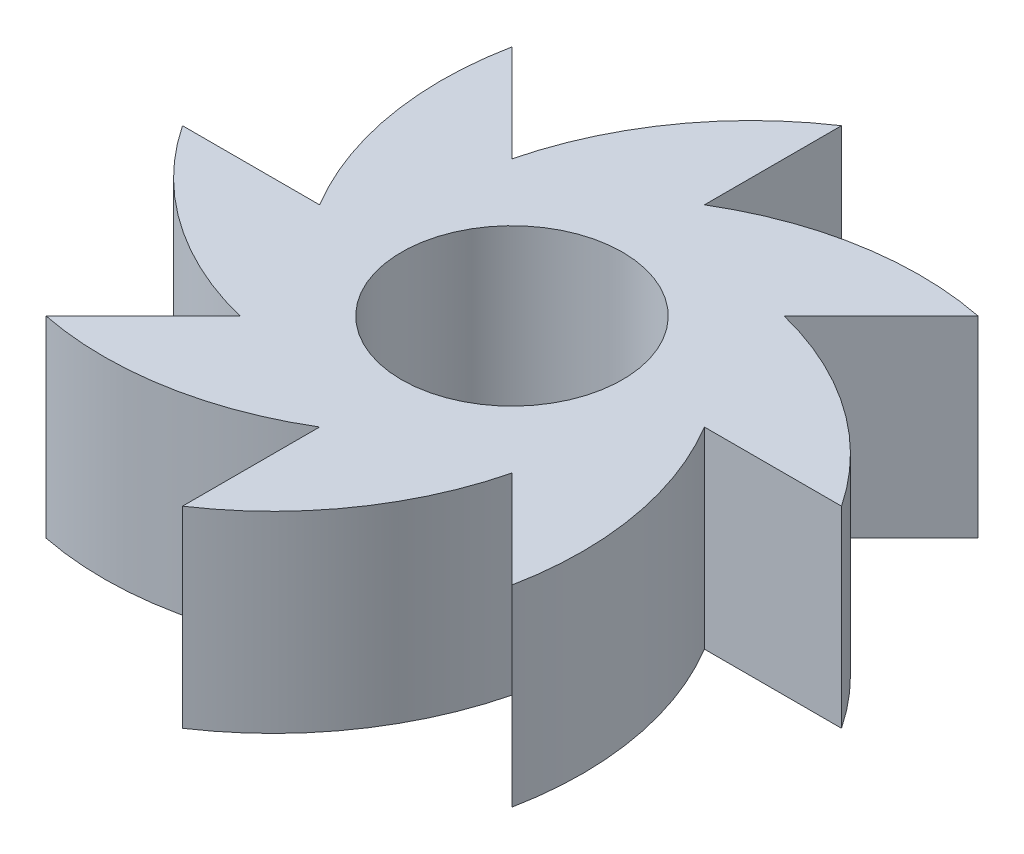
ISO-10303-21;
HEADER;
FILE_DESCRIPTION(('STEP AP214'),'2;1');
FILE_NAME('part.step','',(''),(''),'','','');
FILE_SCHEMA(('AUTOMOTIVE_DESIGN { 1 0 10303 214 1 1 1 1 }'));
ENDSEC;
DATA;
#1=APPLICATION_CONTEXT('core data for automotive mechanical design processes');
#2=APPLICATION_PROTOCOL_DEFINITION('international standard','automotive_design',2000,#1);
#3=PRODUCT_CONTEXT('',#1,'mechanical');
#4=PRODUCT('Part','Part','',(#3));
#5=PRODUCT_RELATED_PRODUCT_CATEGORY('part','',(#4));
#6=PRODUCT_DEFINITION_FORMATION('','',#4);
#7=PRODUCT_DEFINITION_CONTEXT('part definition',#1,'design');
#8=PRODUCT_DEFINITION('design','',#6,#7);
#9=PRODUCT_DEFINITION_SHAPE('','',#8);
#10=(LENGTH_UNIT() NAMED_UNIT(*) SI_UNIT(.MILLI.,.METRE.));
#11=(NAMED_UNIT(*) PLANE_ANGLE_UNIT() SI_UNIT($,.RADIAN.));
#12=(NAMED_UNIT(*) SI_UNIT($,.STERADIAN.) SOLID_ANGLE_UNIT());
#13=UNCERTAINTY_MEASURE_WITH_UNIT(LENGTH_MEASURE(1.E-05),#10,'distance_accuracy_value','');
#14=(GEOMETRIC_REPRESENTATION_CONTEXT(3) GLOBAL_UNCERTAINTY_ASSIGNED_CONTEXT((#13)) GLOBAL_UNIT_ASSIGNED_CONTEXT((#10,
#11,#12)) REPRESENTATION_CONTEXT('',''));
#15=CARTESIAN_POINT('',(0.,0.,0.));
#16=DIRECTION('',(0.,0.,1.));
#17=DIRECTION('',(1.,0.,0.));
#18=AXIS2_PLACEMENT_3D('',#15,#16,#17);
#19=CARTESIAN_POINT('',(-41.2716484049322,47.,-21.532116835391));
#20=DIRECTION('',(0.,-1.,0.));
#21=DIRECTION('',(0.,0.,-1.));
#22=AXIS2_PLACEMENT_3D('',#19,#20,#21);
#23=CYLINDRICAL_SURFACE('',#22,80.0000000000009);
#24=CARTESIAN_POINT('',(-41.2716484049322,0.,-21.532116835391));
#25=DIRECTION('',(0.,1.,0.));
#26=DIRECTION('',(0.,0.,1.));
#27=AXIS2_PLACEMENT_3D('',#24,#25,#26);
#28=CIRCLE('',#27,80.0000000000009);
#29=CARTESIAN_POINT('',(-1.06685493772574E-13,0.,47.));
#30=VERTEX_POINT('',#29);
#31=CARTESIAN_POINT('',(-56.9220958855151,0.,56.9220958855191));
#32=VERTEX_POINT('',#31);
#33=EDGE_CURVE('E196',#30,#32,#28,.F.);
#34=ORIENTED_EDGE('',*,*,#33,.F.);
#35=DIRECTION('',(0.,-1.,0.));
#36=VECTOR('',#35,1.);
#37=CARTESIAN_POINT('',(-1.06685493772574E-13,47.,47.));
#38=LINE('',#37,#36);
#39=CARTESIAN_POINT('',(-1.06685493772574E-13,47.,47.));
#40=VERTEX_POINT('',#39);
#41=EDGE_CURVE('E11',#40,#30,#38,.T.);
#42=ORIENTED_EDGE('',*,*,#41,.F.);
#43=CARTESIAN_POINT('',(-41.2716484049322,47.,-21.532116835391));
#44=DIRECTION('',(0.,1.,0.));
#45=DIRECTION('',(0.,0.,1.));
#46=AXIS2_PLACEMENT_3D('',#43,#44,#45);
#47=CIRCLE('',#46,80.0000000000009);
#48=CARTESIAN_POINT('',(-56.9220958855151,47.,56.9220958855191));
#49=VERTEX_POINT('',#48);
#50=EDGE_CURVE('E322',#40,#49,#47,.F.);
#51=ORIENTED_EDGE('',*,*,#50,.T.);
#52=DIRECTION('',(0.,-1.,0.));
#53=VECTOR('',#52,1.);
#54=CARTESIAN_POINT('',(-56.9220958855151,47.,56.9220958855191));
#55=LINE('',#54,#53);
#56=EDGE_CURVE('E63',#49,#32,#55,.T.);
#57=ORIENTED_EDGE('',*,*,#56,.T.);
#58=EDGE_LOOP('',(#34,#42,#51,#57));
#59=FACE_BOUND('',#58,.T.);
#60=ADVANCED_FACE('F45',(#59),#23,.T.);
#61=CARTESIAN_POINT('',(-3.70939494983768E-12,47.,0.));
#62=DIRECTION('',(-1.,0.,0.));
#63=DIRECTION('',(0.,0.,1.));
#64=AXIS2_PLACEMENT_3D('',#61,#62,#63);
#65=PLANE('',#64);
#66=DIRECTION('',(0.,0.,-1.));
#67=VECTOR('',#66,1.);
#68=CARTESIAN_POINT('',(-3.70939494983768E-12,0.,0.));
#69=LINE('',#68,#67);
#70=CARTESIAN_POINT('',(2.40029406712006E-12,0.,80.500000000001));
#71=VERTEX_POINT('',#70);
#72=EDGE_CURVE('E199',#71,#30,#69,.T.);
#73=ORIENTED_EDGE('',*,*,#72,.F.);
#74=DIRECTION('',(0.,-1.,0.));
#75=VECTOR('',#74,1.);
#76=CARTESIAN_POINT('',(2.40029406712006E-12,47.,80.500000000001));
#77=LINE('',#76,#75);
#78=CARTESIAN_POINT('',(2.40029406712006E-12,47.,80.500000000001));
#79=VERTEX_POINT('',#78);
#80=EDGE_CURVE('E55',#79,#71,#77,.T.);
#81=ORIENTED_EDGE('',*,*,#80,.F.);
#82=DIRECTION('',(0.,0.,-1.));
#83=VECTOR('',#82,1.);
#84=CARTESIAN_POINT('',(-3.70939494983768E-12,47.,0.));
#85=LINE('',#84,#83);
#86=EDGE_CURVE('E315',#79,#40,#85,.T.);
#87=ORIENTED_EDGE('',*,*,#86,.T.);
#88=ORIENTED_EDGE('',*,*,#41,.T.);
#89=EDGE_LOOP('',(#73,#81,#87,#88));
#90=FACE_BOUND('',#89,.T.);
#91=ADVANCED_FACE('F303',(#90),#65,.T.);
#92=CARTESIAN_POINT('',(-44.4089682854805,47.,13.9579566302686));
#93=DIRECTION('',(0.,-1.,0.));
#94=DIRECTION('',(0.,0.,-1.));
#95=AXIS2_PLACEMENT_3D('',#92,#93,#94);
#96=CYLINDRICAL_SURFACE('',#95,80.0000000000012);
#97=CARTESIAN_POINT('',(-44.4089682854805,0.,13.9579566302686));
#98=DIRECTION('',(0.,1.,0.));
#99=DIRECTION('',(0.,0.,1.));
#100=AXIS2_PLACEMENT_3D('',#97,#98,#99);
#101=CIRCLE('',#100,80.0000000000012);
#102=CARTESIAN_POINT('',(33.2340187157677,0.,33.2340187157678));
#103=VERTEX_POINT('',#102);
#104=EDGE_CURVE('E203',#103,#71,#101,.F.);
#105=ORIENTED_EDGE('',*,*,#104,.F.);
#106=DIRECTION('',(0.,-1.,0.));
#107=VECTOR('',#106,1.);
#108=CARTESIAN_POINT('',(33.2340187157677,47.,33.2340187157678));
#109=LINE('',#108,#107);
#110=CARTESIAN_POINT('',(33.2340187157677,47.,33.2340187157678));
#111=VERTEX_POINT('',#110);
#112=EDGE_CURVE('E290',#111,#103,#109,.T.);
#113=ORIENTED_EDGE('',*,*,#112,.F.);
#114=CARTESIAN_POINT('',(-44.4089682854805,47.,13.9579566302686));
#115=DIRECTION('',(0.,1.,0.));
#116=DIRECTION('',(0.,0.,1.));
#117=AXIS2_PLACEMENT_3D('',#114,#115,#116);
#118=CIRCLE('',#117,80.0000000000012);
#119=EDGE_CURVE('E299',#111,#79,#118,.F.);
#120=ORIENTED_EDGE('',*,*,#119,.T.);
#121=ORIENTED_EDGE('',*,*,#80,.T.);
#122=EDGE_LOOP('',(#105,#113,#120,#121));
#123=FACE_BOUND('',#122,.T.);
#124=ADVANCED_FACE('F297',(#123),#96,.T.);
#125=CARTESIAN_POINT('',(0.,47.,0.));
#126=DIRECTION('',(-0.707106781186549,0.,0.707106781186546));
#127=DIRECTION('',(0.707106781186546,0.,0.707106781186549));
#128=AXIS2_PLACEMENT_3D('',#125,#126,#127);
#129=PLANE('',#128);
#130=DIRECTION('',(-0.707106781186546,0.,-0.707106781186549));
#131=VECTOR('',#130,1.);
#132=CARTESIAN_POINT('',(0.,0.,0.));
#133=LINE('',#132,#131);
#134=CARTESIAN_POINT('',(56.922095885517,0.,56.9220958855172));
#135=VERTEX_POINT('',#134);
#136=EDGE_CURVE('E207',#135,#103,#133,.T.);
#137=ORIENTED_EDGE('',*,*,#136,.F.);
#138=DIRECTION('',(0.,-1.,0.));
#139=VECTOR('',#138,1.);
#140=CARTESIAN_POINT('',(56.922095885517,47.,56.9220958855172));
#141=LINE('',#140,#139);
#142=CARTESIAN_POINT('',(56.922095885517,47.,56.9220958855172));
#143=VERTEX_POINT('',#142);
#144=EDGE_CURVE('E287',#143,#135,#141,.T.);
#145=ORIENTED_EDGE('',*,*,#144,.F.);
#146=DIRECTION('',(-0.707106781186546,0.,-0.707106781186549));
#147=VECTOR('',#146,1.);
#148=CARTESIAN_POINT('',(0.,47.,0.));
#149=LINE('',#148,#147);
#150=EDGE_CURVE('E312',#143,#111,#149,.T.);
#151=ORIENTED_EDGE('',*,*,#150,.T.);
#152=ORIENTED_EDGE('',*,*,#112,.T.);
#153=EDGE_LOOP('',(#137,#145,#151,#152));
#154=FACE_BOUND('',#153,.T.);
#155=ADVANCED_FACE('F309',(#154),#129,.T.);
#156=CARTESIAN_POINT('',(-21.5321168353908,47.,41.2716484049323));
#157=DIRECTION('',(0.,-1.,0.));
#158=DIRECTION('',(0.,0.,-1.));
#159=AXIS2_PLACEMENT_3D('',#156,#157,#158);
#160=CYLINDRICAL_SURFACE('',#159,80.);
#161=CARTESIAN_POINT('',(-21.5321168353908,0.,41.2716484049323));
#162=DIRECTION('',(0.,1.,0.));
#163=DIRECTION('',(0.,0.,1.));
#164=AXIS2_PLACEMENT_3D('',#161,#162,#163);
#165=CIRCLE('',#164,80.);
#166=CARTESIAN_POINT('',(47.,0.,0.));
#167=VERTEX_POINT('',#166);
#168=EDGE_CURVE('E211',#167,#135,#165,.F.);
#169=ORIENTED_EDGE('',*,*,#168,.F.);
#170=DIRECTION('',(0.,-1.,0.));
#171=VECTOR('',#170,1.);
#172=CARTESIAN_POINT('',(47.,47.,0.));
#173=LINE('',#172,#171);
#174=CARTESIAN_POINT('',(47.,47.,0.));
#175=VERTEX_POINT('',#174);
#176=EDGE_CURVE('E284',#175,#167,#173,.T.);
#177=ORIENTED_EDGE('',*,*,#176,.F.);
#178=CARTESIAN_POINT('',(-21.5321168353908,47.,41.2716484049323));
#179=DIRECTION('',(0.,1.,0.));
#180=DIRECTION('',(0.,0.,1.));
#181=AXIS2_PLACEMENT_3D('',#178,#179,#180);
#182=CIRCLE('',#181,80.);
#183=EDGE_CURVE('E320',#175,#143,#182,.F.);
#184=ORIENTED_EDGE('',*,*,#183,.T.);
#185=ORIENTED_EDGE('',*,*,#144,.T.);
#186=EDGE_LOOP('',(#169,#177,#184,#185));
#187=FACE_BOUND('',#186,.T.);
#188=ADVANCED_FACE('F382',(#187),#160,.T.);
#189=CARTESIAN_POINT('',(0.,47.,0.));
#190=DIRECTION('',(0.,0.,1.));
#191=DIRECTION('',(1.,0.,0.));
#192=AXIS2_PLACEMENT_3D('',#189,#190,#191);
#193=PLANE('',#192);
#194=DIRECTION('',(-1.,0.,0.));
#195=VECTOR('',#194,1.);
#196=CARTESIAN_POINT('',(0.,0.,0.));
#197=LINE('',#196,#195);
#198=CARTESIAN_POINT('',(80.5,0.,0.));
#199=VERTEX_POINT('',#198);
#200=EDGE_CURVE('E215',#199,#167,#197,.T.);
#201=ORIENTED_EDGE('',*,*,#200,.F.);
#202=DIRECTION('',(0.,-1.,0.));
#203=VECTOR('',#202,1.);
#204=CARTESIAN_POINT('',(80.5,47.,0.));
#205=LINE('',#204,#203);
#206=CARTESIAN_POINT('',(80.5,47.,0.));
#207=VERTEX_POINT('',#206);
#208=EDGE_CURVE('E281',#207,#199,#205,.T.);
#209=ORIENTED_EDGE('',*,*,#208,.F.);
#210=DIRECTION('',(-1.,0.,0.));
#211=VECTOR('',#210,1.);
#212=CARTESIAN_POINT('',(0.,47.,0.));
#213=LINE('',#212,#211);
#214=EDGE_CURVE('E328',#207,#175,#213,.T.);
#215=ORIENTED_EDGE('',*,*,#214,.T.);
#216=ORIENTED_EDGE('',*,*,#176,.T.);
#217=EDGE_LOOP('',(#201,#209,#215,#216));
#218=FACE_BOUND('',#217,.T.);
#219=ADVANCED_FACE('F385',(#218),#193,.T.);
#220=CARTESIAN_POINT('',(13.9579566302688,47.,44.4089682854805));
#221=DIRECTION('',(0.,-1.,0.));
#222=DIRECTION('',(0.,0.,-1.));
#223=AXIS2_PLACEMENT_3D('',#220,#221,#222);
#224=CYLINDRICAL_SURFACE('',#223,80.);
#225=CARTESIAN_POINT('',(13.9579566302688,0.,44.4089682854805));
#226=DIRECTION('',(0.,1.,0.));
#227=DIRECTION('',(0.,0.,1.));
#228=AXIS2_PLACEMENT_3D('',#225,#226,#227);
#229=CIRCLE('',#228,80.);
#230=CARTESIAN_POINT('',(33.2340187157677,0.,-33.2340187157678));
#231=VERTEX_POINT('',#230);
#232=EDGE_CURVE('E219',#231,#199,#229,.F.);
#233=ORIENTED_EDGE('',*,*,#232,.F.);
#234=DIRECTION('',(0.,-1.,0.));
#235=VECTOR('',#234,1.);
#236=CARTESIAN_POINT('',(33.2340187157677,47.,-33.2340187157678));
#237=LINE('',#236,#235);
#238=CARTESIAN_POINT('',(33.2340187157677,47.,-33.2340187157678));
#239=VERTEX_POINT('',#238);
#240=EDGE_CURVE('E278',#239,#231,#237,.T.);
#241=ORIENTED_EDGE('',*,*,#240,.F.);
#242=CARTESIAN_POINT('',(13.9579566302688,47.,44.4089682854805));
#243=DIRECTION('',(0.,1.,0.));
#244=DIRECTION('',(0.,0.,1.));
#245=AXIS2_PLACEMENT_3D('',#242,#243,#244);
#246=CIRCLE('',#245,80.);
#247=EDGE_CURVE('E332',#239,#207,#246,.F.);
#248=ORIENTED_EDGE('',*,*,#247,.T.);
#249=ORIENTED_EDGE('',*,*,#208,.T.);
#250=EDGE_LOOP('',(#233,#241,#248,#249));
#251=FACE_BOUND('',#250,.T.);
#252=ADVANCED_FACE('F389',(#251),#224,.T.);
#253=CARTESIAN_POINT('',(0.,47.,0.));
#254=DIRECTION('',(0.707106781186549,0.,0.707106781186546));
#255=DIRECTION('',(0.707106781186546,0.,-0.707106781186549));
#256=AXIS2_PLACEMENT_3D('',#253,#254,#255);
#257=PLANE('',#256);
#258=DIRECTION('',(-0.707106781186546,0.,0.707106781186549));
#259=VECTOR('',#258,1.);
#260=CARTESIAN_POINT('',(0.,0.,0.));
#261=LINE('',#260,#259);
#262=CARTESIAN_POINT('',(56.922095885517,0.,-56.9220958855172));
#263=VERTEX_POINT('',#262);
#264=EDGE_CURVE('E223',#263,#231,#261,.T.);
#265=ORIENTED_EDGE('',*,*,#264,.F.);
#266=DIRECTION('',(0.,-1.,0.));
#267=VECTOR('',#266,1.);
#268=CARTESIAN_POINT('',(56.922095885517,47.,-56.9220958855172));
#269=LINE('',#268,#267);
#270=CARTESIAN_POINT('',(56.922095885517,47.,-56.9220958855172));
#271=VERTEX_POINT('',#270);
#272=EDGE_CURVE('E275',#271,#263,#269,.T.);
#273=ORIENTED_EDGE('',*,*,#272,.F.);
#274=DIRECTION('',(-0.707106781186546,0.,0.707106781186549));
#275=VECTOR('',#274,1.);
#276=CARTESIAN_POINT('',(0.,47.,0.));
#277=LINE('',#276,#275);
#278=EDGE_CURVE('E336',#271,#239,#277,.T.);
#279=ORIENTED_EDGE('',*,*,#278,.T.);
#280=ORIENTED_EDGE('',*,*,#240,.T.);
#281=EDGE_LOOP('',(#265,#273,#279,#280));
#282=FACE_BOUND('',#281,.T.);
#283=ADVANCED_FACE('F393',(#282),#257,.T.);
#284=CARTESIAN_POINT('',(41.2716484049324,47.,21.5321168353907));
#285=DIRECTION('',(0.,-1.,0.));
#286=DIRECTION('',(0.,0.,-1.));
#287=AXIS2_PLACEMENT_3D('',#284,#285,#286);
#288=CYLINDRICAL_SURFACE('',#287,80.);
#289=CARTESIAN_POINT('',(41.2716484049324,0.,21.5321168353907));
#290=DIRECTION('',(0.,1.,0.));
#291=DIRECTION('',(0.,0.,1.));
#292=AXIS2_PLACEMENT_3D('',#289,#290,#291);
#293=CIRCLE('',#292,80.);
#294=CARTESIAN_POINT('',(4.92298868776882E-13,0.,-47.));
#295=VERTEX_POINT('',#294);
#296=EDGE_CURVE('E227',#295,#263,#293,.F.);
#297=ORIENTED_EDGE('',*,*,#296,.F.);
#298=DIRECTION('',(0.,-1.,0.));
#299=VECTOR('',#298,1.);
#300=CARTESIAN_POINT('',(4.92298868776882E-13,47.,-47.));
#301=LINE('',#300,#299);
#302=CARTESIAN_POINT('',(4.92298868776882E-13,47.,-47.));
#303=VERTEX_POINT('',#302);
#304=EDGE_CURVE('E272',#303,#295,#301,.T.);
#305=ORIENTED_EDGE('',*,*,#304,.F.);
#306=CARTESIAN_POINT('',(41.2716484049324,47.,21.5321168353907));
#307=DIRECTION('',(0.,1.,0.));
#308=DIRECTION('',(0.,0.,1.));
#309=AXIS2_PLACEMENT_3D('',#306,#307,#308);
#310=CIRCLE('',#309,80.);
#311=EDGE_CURVE('E340',#303,#271,#310,.F.);
#312=ORIENTED_EDGE('',*,*,#311,.T.);
#313=ORIENTED_EDGE('',*,*,#272,.T.);
#314=EDGE_LOOP('',(#297,#305,#312,#313));
#315=FACE_BOUND('',#314,.T.);
#316=ADVANCED_FACE('F397',(#315),#288,.T.);
#317=CARTESIAN_POINT('',(0.,47.,0.));
#318=DIRECTION('',(1.,0.,0.));
#319=DIRECTION('',(0.,0.,-1.));
#320=AXIS2_PLACEMENT_3D('',#317,#318,#319);
#321=PLANE('',#320);
#322=DIRECTION('',(0.,0.,1.));
#323=VECTOR('',#322,1.);
#324=CARTESIAN_POINT('',(0.,0.,0.));
#325=LINE('',#324,#323);
#326=CARTESIAN_POINT('',(8.39606162372775E-13,0.,-80.5));
#327=VERTEX_POINT('',#326);
#328=EDGE_CURVE('E231',#327,#295,#325,.T.);
#329=ORIENTED_EDGE('',*,*,#328,.F.);
#330=DIRECTION('',(0.,-1.,0.));
#331=VECTOR('',#330,1.);
#332=CARTESIAN_POINT('',(8.39606162372775E-13,47.,-80.5));
#333=LINE('',#332,#331);
#334=CARTESIAN_POINT('',(8.39606162372775E-13,47.,-80.5));
#335=VERTEX_POINT('',#334);
#336=EDGE_CURVE('E269',#335,#327,#333,.T.);
#337=ORIENTED_EDGE('',*,*,#336,.F.);
#338=DIRECTION('',(0.,0.,1.));
#339=VECTOR('',#338,1.);
#340=CARTESIAN_POINT('',(0.,47.,0.));
#341=LINE('',#340,#339);
#342=EDGE_CURVE('E344',#335,#303,#341,.T.);
#343=ORIENTED_EDGE('',*,*,#342,.T.);
#344=ORIENTED_EDGE('',*,*,#304,.T.);
#345=EDGE_LOOP('',(#329,#337,#343,#344));
#346=FACE_BOUND('',#345,.T.);
#347=ADVANCED_FACE('F401',(#346),#321,.T.);
#348=CARTESIAN_POINT('',(44.4089682854806,47.,-13.9579566302683));
#349=DIRECTION('',(0.,-1.,0.));
#350=DIRECTION('',(0.,0.,-1.));
#351=AXIS2_PLACEMENT_3D('',#348,#349,#350);
#352=CYLINDRICAL_SURFACE('',#351,80.);
#353=CARTESIAN_POINT('',(44.4089682854806,0.,-13.9579566302683));
#354=DIRECTION('',(0.,1.,0.));
#355=DIRECTION('',(0.,0.,1.));
#356=AXIS2_PLACEMENT_3D('',#353,#354,#355);
#357=CIRCLE('',#356,80.);
#358=CARTESIAN_POINT('',(-33.2340187157674,0.,-33.234018715768));
#359=VERTEX_POINT('',#358);
#360=EDGE_CURVE('E235',#359,#327,#357,.F.);
#361=ORIENTED_EDGE('',*,*,#360,.F.);
#362=DIRECTION('',(0.,-1.,0.));
#363=VECTOR('',#362,1.);
#364=CARTESIAN_POINT('',(-33.2340187157674,47.,-33.234018715768));
#365=LINE('',#364,#363);
#366=CARTESIAN_POINT('',(-33.2340187157674,47.,-33.234018715768));
#367=VERTEX_POINT('',#366);
#368=EDGE_CURVE('E266',#367,#359,#365,.T.);
#369=ORIENTED_EDGE('',*,*,#368,.F.);
#370=CARTESIAN_POINT('',(44.4089682854806,47.,-13.9579566302683));
#371=DIRECTION('',(0.,1.,0.));
#372=DIRECTION('',(0.,0.,1.));
#373=AXIS2_PLACEMENT_3D('',#370,#371,#372);
#374=CIRCLE('',#373,80.);
#375=EDGE_CURVE('E348',#367,#335,#374,.F.);
#376=ORIENTED_EDGE('',*,*,#375,.T.);
#377=ORIENTED_EDGE('',*,*,#336,.T.);
#378=EDGE_LOOP('',(#361,#369,#376,#377));
#379=FACE_BOUND('',#378,.T.);
#380=ADVANCED_FACE('F405',(#379),#352,.T.);
#381=CARTESIAN_POINT('',(0.,47.,0.));
#382=DIRECTION('',(0.707106781186554,0.,-0.707106781186541));
#383=DIRECTION('',(-0.707106781186541,0.,-0.707106781186554));
#384=AXIS2_PLACEMENT_3D('',#381,#382,#383);
#385=PLANE('',#384);
#386=DIRECTION('',(0.707106781186541,0.,0.707106781186554));
#387=VECTOR('',#386,1.);
#388=CARTESIAN_POINT('',(0.,0.,0.));
#389=LINE('',#388,#387);
#390=CARTESIAN_POINT('',(-56.9220958855166,0.,-56.9220958855176));
#391=VERTEX_POINT('',#390);
#392=EDGE_CURVE('E239',#391,#359,#389,.T.);
#393=ORIENTED_EDGE('',*,*,#392,.F.);
#394=DIRECTION('',(0.,-1.,0.));
#395=VECTOR('',#394,1.);
#396=CARTESIAN_POINT('',(-56.9220958855166,47.,-56.9220958855176));
#397=LINE('',#396,#395);
#398=CARTESIAN_POINT('',(-56.9220958855166,47.,-56.9220958855176));
#399=VERTEX_POINT('',#398);
#400=EDGE_CURVE('E263',#399,#391,#397,.T.);
#401=ORIENTED_EDGE('',*,*,#400,.F.);
#402=DIRECTION('',(0.707106781186541,0.,0.707106781186554));
#403=VECTOR('',#402,1.);
#404=CARTESIAN_POINT('',(0.,47.,0.));
#405=LINE('',#404,#403);
#406=EDGE_CURVE('E352',#399,#367,#405,.T.);
#407=ORIENTED_EDGE('',*,*,#406,.T.);
#408=ORIENTED_EDGE('',*,*,#368,.T.);
#409=EDGE_LOOP('',(#393,#401,#407,#408));
#410=FACE_BOUND('',#409,.T.);
#411=ADVANCED_FACE('F409',(#410),#385,.T.);
#412=CARTESIAN_POINT('',(21.5321168353911,47.,-41.2716484049322));
#413=DIRECTION('',(0.,-1.,0.));
#414=DIRECTION('',(0.,0.,-1.));
#415=AXIS2_PLACEMENT_3D('',#412,#413,#414);
#416=CYLINDRICAL_SURFACE('',#415,80.0000000000003);
#417=CARTESIAN_POINT('',(21.5321168353911,0.,-41.2716484049322));
#418=DIRECTION('',(0.,1.,0.));
#419=DIRECTION('',(0.,0.,1.));
#420=AXIS2_PLACEMENT_3D('',#417,#418,#419);
#421=CIRCLE('',#420,80.0000000000003);
#422=CARTESIAN_POINT('',(-46.9999999999993,0.,2.3523170727818E-12));
#423=VERTEX_POINT('',#422);
#424=EDGE_CURVE('E243',#423,#391,#421,.F.);
#425=ORIENTED_EDGE('',*,*,#424,.F.);
#426=DIRECTION('',(0.,-1.,0.));
#427=VECTOR('',#426,1.);
#428=CARTESIAN_POINT('',(-46.9999999999993,47.,2.3523170727818E-12));
#429=LINE('',#428,#427);
#430=CARTESIAN_POINT('',(-46.9999999999993,47.,2.3523170727818E-12));
#431=VERTEX_POINT('',#430);
#432=EDGE_CURVE('E171',#431,#423,#429,.T.);
#433=ORIENTED_EDGE('',*,*,#432,.F.);
#434=CARTESIAN_POINT('',(21.5321168353911,47.,-41.2716484049322));
#435=DIRECTION('',(0.,1.,0.));
#436=DIRECTION('',(0.,0.,1.));
#437=AXIS2_PLACEMENT_3D('',#434,#435,#436);
#438=CIRCLE('',#437,80.0000000000003);
#439=EDGE_CURVE('E181',#431,#399,#438,.F.);
#440=ORIENTED_EDGE('',*,*,#439,.T.);
#441=ORIENTED_EDGE('',*,*,#400,.T.);
#442=EDGE_LOOP('',(#425,#433,#440,#441));
#443=FACE_BOUND('',#442,.T.);
#444=ADVANCED_FACE('F358',(#443),#416,.T.);
#445=CARTESIAN_POINT('',(0.,47.,2.26553573663655E-12));
#446=DIRECTION('',(0.,0.,-1.));
#447=DIRECTION('',(-1.,0.,0.));
#448=AXIS2_PLACEMENT_3D('',#445,#446,#447);
#449=PLANE('',#448);
#450=DIRECTION('',(1.,0.,0.));
#451=VECTOR('',#450,1.);
#452=CARTESIAN_POINT('',(0.,0.,2.26553573663655E-12));
#453=LINE('',#452,#451);
#454=CARTESIAN_POINT('',(-80.4999999999991,0.,2.41417185492787E-12));
#455=VERTEX_POINT('',#454);
#456=EDGE_CURVE('E166',#455,#423,#453,.T.);
#457=ORIENTED_EDGE('',*,*,#456,.F.);
#458=DIRECTION('',(0.,-1.,0.));
#459=VECTOR('',#458,1.);
#460=CARTESIAN_POINT('',(-80.4999999999991,47.,2.41417185492787E-12));
#461=LINE('',#460,#459);
#462=CARTESIAN_POINT('',(-80.4999999999991,47.,2.41417185492787E-12));
#463=VERTEX_POINT('',#462);
#464=EDGE_CURVE('E161',#463,#455,#461,.T.);
#465=ORIENTED_EDGE('',*,*,#464,.F.);
#466=DIRECTION('',(1.,0.,0.));
#467=VECTOR('',#466,1.);
#468=CARTESIAN_POINT('',(0.,47.,2.26553573663655E-12));
#469=LINE('',#468,#467);
#470=EDGE_CURVE('E164',#463,#431,#469,.T.);
#471=ORIENTED_EDGE('',*,*,#470,.T.);
#472=ORIENTED_EDGE('',*,*,#432,.T.);
#473=EDGE_LOOP('',(#457,#465,#471,#472));
#474=FACE_BOUND('',#473,.T.);
#475=ADVANCED_FACE('F163',(#474),#449,.T.);
#476=CARTESIAN_POINT('',(-13.9579566302685,47.,-44.4089682854806));
#477=DIRECTION('',(0.,-1.,0.));
#478=DIRECTION('',(0.,0.,-1.));
#479=AXIS2_PLACEMENT_3D('',#476,#477,#478);
#480=CYLINDRICAL_SURFACE('',#479,80.0000000000013);
#481=CARTESIAN_POINT('',(-13.9579566302685,0.,-44.4089682854806));
#482=DIRECTION('',(0.,1.,0.));
#483=DIRECTION('',(0.,0.,1.));
#484=AXIS2_PLACEMENT_3D('',#481,#482,#483);
#485=CIRCLE('',#484,80.0000000000013);
#486=CARTESIAN_POINT('',(-33.2340187157658,0.,33.2340187157697));
#487=VERTEX_POINT('',#486);
#488=EDGE_CURVE('E249',#487,#455,#485,.F.);
#489=ORIENTED_EDGE('',*,*,#488,.F.);
#490=DIRECTION('',(0.,-1.,0.));
#491=VECTOR('',#490,1.);
#492=CARTESIAN_POINT('',(-33.2340187157658,47.,33.2340187157697));
#493=LINE('',#492,#491);
#494=CARTESIAN_POINT('',(-33.2340187157658,47.,33.2340187157697));
#495=VERTEX_POINT('',#494);
#496=EDGE_CURVE('E112',#495,#487,#493,.T.);
#497=ORIENTED_EDGE('',*,*,#496,.F.);
#498=CARTESIAN_POINT('',(-13.9579566302685,47.,-44.4089682854806));
#499=DIRECTION('',(0.,1.,0.));
#500=DIRECTION('',(0.,0.,1.));
#501=AXIS2_PLACEMENT_3D('',#498,#499,#500);
#502=CIRCLE('',#501,80.0000000000013);
#503=EDGE_CURVE('E178',#495,#463,#502,.F.);
#504=ORIENTED_EDGE('',*,*,#503,.T.);
#505=ORIENTED_EDGE('',*,*,#464,.T.);
#506=EDGE_LOOP('',(#489,#497,#504,#505));
#507=FACE_BOUND('',#506,.T.);
#508=ADVANCED_FACE('F184',(#507),#480,.T.);
#509=CARTESIAN_POINT('',(0.,47.,0.));
#510=DIRECTION('',(0.,-1.,0.));
#511=DIRECTION('',(0.,0.,-1.));
#512=AXIS2_PLACEMENT_3D('',#509,#510,#511);
#513=CYLINDRICAL_SURFACE('',#512,27.);
#514=CARTESIAN_POINT('',(0.,47.,0.));
#515=DIRECTION('',(0.,1.,0.));
#516=DIRECTION('',(0.,0.,1.));
#517=AXIS2_PLACEMENT_3D('',#514,#515,#516);
#518=CIRCLE('',#517,27.);
#519=CARTESIAN_POINT('',(0.,47.,27.));
#520=VERTEX_POINT('',#519);
#521=EDGE_CURVE('E256',#520,#520,#518,.T.);
#522=ORIENTED_EDGE('',*,*,#521,.T.);
#523=EDGE_LOOP('',(#522));
#524=FACE_BOUND('',#523,.T.);
#525=CARTESIAN_POINT('',(0.,0.,0.));
#526=DIRECTION('',(0.,1.,0.));
#527=DIRECTION('',(0.,0.,1.));
#528=AXIS2_PLACEMENT_3D('',#525,#526,#527);
#529=CIRCLE('',#528,27.);
#530=CARTESIAN_POINT('',(0.,0.,27.));
#531=VERTEX_POINT('',#530);
#532=EDGE_CURVE('E192',#531,#531,#529,.T.);
#533=ORIENTED_EDGE('',*,*,#532,.F.);
#534=EDGE_LOOP('',(#533));
#535=FACE_BOUND('',#534,.T.);
#536=ADVANCED_FACE('F47',(#524,#535),#513,.F.);
#537=CARTESIAN_POINT('',(1.88411095042053E-12,47.,1.88411095042053E-12));
#538=DIRECTION('',(-0.707106781186549,0.,-0.707106781186546));
#539=DIRECTION('',(-0.707106781186546,0.,0.707106781186549));
#540=AXIS2_PLACEMENT_3D('',#537,#538,#539);
#541=PLANE('',#540);
#542=DIRECTION('',(0.707106781186546,0.,-0.707106781186549));
#543=VECTOR('',#542,1.);
#544=CARTESIAN_POINT('',(1.88411095042053E-12,0.,1.88411095042053E-12));
#545=LINE('',#544,#543);
#546=EDGE_CURVE('E252',#32,#487,#545,.T.);
#547=ORIENTED_EDGE('',*,*,#546,.F.);
#548=ORIENTED_EDGE('',*,*,#56,.F.);
#549=DIRECTION('',(0.707106781186546,0.,-0.707106781186549));
#550=VECTOR('',#549,1.);
#551=CARTESIAN_POINT('',(1.88411095042053E-12,47.,1.88411095042053E-12));
#552=LINE('',#551,#550);
#553=EDGE_CURVE('E186',#49,#495,#552,.T.);
#554=ORIENTED_EDGE('',*,*,#553,.T.);
#555=ORIENTED_EDGE('',*,*,#496,.T.);
#556=EDGE_LOOP('',(#547,#548,#554,#555));
#557=FACE_BOUND('',#556,.T.);
#558=ADVANCED_FACE('F360',(#557),#541,.T.);
#559=CARTESIAN_POINT('',(0.,47.,0.));
#560=DIRECTION('',(0.,1.,0.));
#561=DIRECTION('',(0.,0.,1.));
#562=AXIS2_PLACEMENT_3D('',#559,#560,#561);
#563=PLANE('',#562);
#564=ORIENTED_EDGE('',*,*,#521,.F.);
#565=EDGE_LOOP('',(#564));
#566=FACE_BOUND('',#565,.T.);
#567=ORIENTED_EDGE('',*,*,#50,.F.);
#568=ORIENTED_EDGE('',*,*,#86,.F.);
#569=ORIENTED_EDGE('',*,*,#119,.F.);
#570=ORIENTED_EDGE('',*,*,#150,.F.);
#571=ORIENTED_EDGE('',*,*,#183,.F.);
#572=ORIENTED_EDGE('',*,*,#214,.F.);
#573=ORIENTED_EDGE('',*,*,#247,.F.);
#574=ORIENTED_EDGE('',*,*,#278,.F.);
#575=ORIENTED_EDGE('',*,*,#311,.F.);
#576=ORIENTED_EDGE('',*,*,#342,.F.);
#577=ORIENTED_EDGE('',*,*,#375,.F.);
#578=ORIENTED_EDGE('',*,*,#406,.F.);
#579=ORIENTED_EDGE('',*,*,#439,.F.);
#580=ORIENTED_EDGE('',*,*,#470,.F.);
#581=ORIENTED_EDGE('',*,*,#503,.F.);
#582=ORIENTED_EDGE('',*,*,#553,.F.);
#583=EDGE_LOOP('',(#567,#568,#569,#570,#571,#572,#573,#574,#575,#576,#577,#578,#579,#580,#581,#582));
#584=FACE_BOUND('',#583,.T.);
#585=ADVANCED_FACE('F176',(#566,#584),#563,.T.);
#586=CARTESIAN_POINT('',(0.,0.,0.));
#587=DIRECTION('',(0.,1.,0.));
#588=DIRECTION('',(0.,0.,1.));
#589=AXIS2_PLACEMENT_3D('',#586,#587,#588);
#590=PLANE('',#589);
#591=ORIENTED_EDGE('',*,*,#532,.T.);
#592=EDGE_LOOP('',(#591));
#593=FACE_BOUND('',#592,.T.);
#594=ORIENTED_EDGE('',*,*,#33,.T.);
#595=ORIENTED_EDGE('',*,*,#546,.T.);
#596=ORIENTED_EDGE('',*,*,#488,.T.);
#597=ORIENTED_EDGE('',*,*,#456,.T.);
#598=ORIENTED_EDGE('',*,*,#424,.T.);
#599=ORIENTED_EDGE('',*,*,#392,.T.);
#600=ORIENTED_EDGE('',*,*,#360,.T.);
#601=ORIENTED_EDGE('',*,*,#328,.T.);
#602=ORIENTED_EDGE('',*,*,#296,.T.);
#603=ORIENTED_EDGE('',*,*,#264,.T.);
#604=ORIENTED_EDGE('',*,*,#232,.T.);
#605=ORIENTED_EDGE('',*,*,#200,.T.);
#606=ORIENTED_EDGE('',*,*,#168,.T.);
#607=ORIENTED_EDGE('',*,*,#136,.T.);
#608=ORIENTED_EDGE('',*,*,#104,.T.);
#609=ORIENTED_EDGE('',*,*,#72,.T.);
#610=EDGE_LOOP('',(#594,#595,#596,#597,#598,#599,#600,#601,#602,#603,#604,#605,#606,#607,#608,#609));
#611=FACE_BOUND('',#610,.T.);
#612=ADVANCED_FACE('F305',(#593,#611),#590,.F.);
#613=CLOSED_SHELL('',(#60,#91,#124,#155,#188,#219,#252,#283,#316,#347,#380,#411,#444,#475,#508,
#536,#558,#585,#612));
#614=MANIFOLD_SOLID_BREP('B2',#613);
#615=ADVANCED_BREP_SHAPE_REPRESENTATION('',(#18,#614),#14);
#616=SHAPE_DEFINITION_REPRESENTATION(#9,#615);
ENDSEC;
END-ISO-10303-21;
